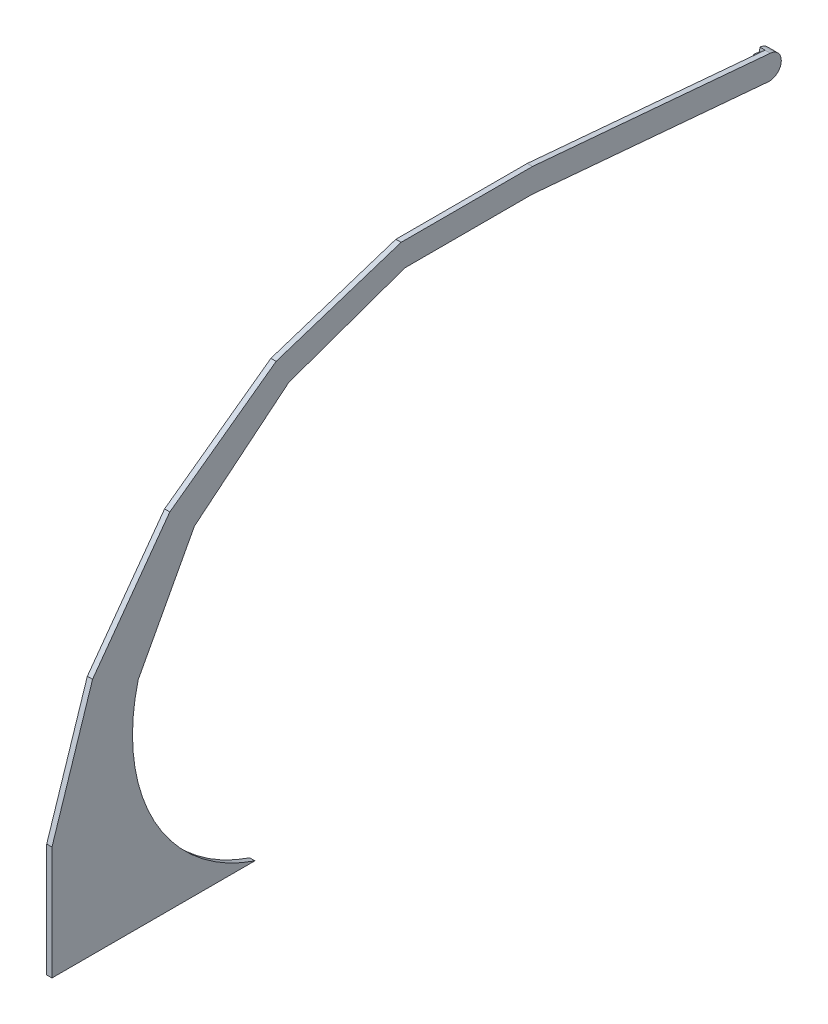
ISO-10303-21;
HEADER;
FILE_DESCRIPTION(('STEP AP214'),'2;1');
FILE_NAME('part.step','',(''),(''),'','','');
FILE_SCHEMA(('AUTOMOTIVE_DESIGN { 1 0 10303 214 1 1 1 1 }'));
ENDSEC;
DATA;
#1=APPLICATION_CONTEXT('core data for automotive mechanical design processes');
#2=APPLICATION_PROTOCOL_DEFINITION('international standard','automotive_design',2000,#1);
#3=PRODUCT_CONTEXT('',#1,'mechanical');
#4=PRODUCT('Part','Part','',(#3));
#5=PRODUCT_RELATED_PRODUCT_CATEGORY('part','',(#4));
#6=PRODUCT_DEFINITION_FORMATION('','',#4);
#7=PRODUCT_DEFINITION_CONTEXT('part definition',#1,'design');
#8=PRODUCT_DEFINITION('design','',#6,#7);
#9=PRODUCT_DEFINITION_SHAPE('','',#8);
#10=(LENGTH_UNIT() NAMED_UNIT(*) SI_UNIT(.MILLI.,.METRE.));
#11=(NAMED_UNIT(*) PLANE_ANGLE_UNIT() SI_UNIT($,.RADIAN.));
#12=(NAMED_UNIT(*) SI_UNIT($,.STERADIAN.) SOLID_ANGLE_UNIT());
#13=UNCERTAINTY_MEASURE_WITH_UNIT(LENGTH_MEASURE(1.E-05),#10,'distance_accuracy_value','');
#14=(GEOMETRIC_REPRESENTATION_CONTEXT(3) GLOBAL_UNCERTAINTY_ASSIGNED_CONTEXT((#13)) GLOBAL_UNIT_ASSIGNED_CONTEXT((#10,
#11,#12)) REPRESENTATION_CONTEXT('',''));
#15=CARTESIAN_POINT('',(0.,0.,0.));
#16=DIRECTION('',(0.,0.,1.));
#17=DIRECTION('',(1.,0.,0.));
#18=AXIS2_PLACEMENT_3D('',#15,#16,#17);
#19=CARTESIAN_POINT('',(-4.4,267.404770623516,-613.486850690672));
#20=DIRECTION('',(1.,0.,0.));
#21=DIRECTION('',(0.,0.,-1.));
#22=AXIS2_PLACEMENT_3D('',#19,#20,#21);
#23=PLANE('',#22);
#24=DIRECTION('',(0.,0.996194698091742,-0.0871557427476948));
#25=VECTOR('',#24,1.);
#26=CARTESIAN_POINT('',(-4.4,277.366717604433,-614.358408118148));
#27=LINE('',#26,#25);
#28=CARTESIAN_POINT('',(-4.4,274.17889457054,-614.079509741355));
#29=VERTEX_POINT('',#28);
#30=CARTESIAN_POINT('',(-4.4,277.366717604433,-614.358408118148));
#31=VERTEX_POINT('',#30);
#32=EDGE_CURVE('E50',#29,#31,#27,.T.);
#33=ORIENTED_EDGE('',*,*,#32,.F.);
#34=DIRECTION('',(0.,-0.0871557427476457,-0.996194698091747));
#35=VECTOR('',#34,1.);
#36=CARTESIAN_POINT('',(-4.4,274.17889457054,-614.079509741355));
#37=LINE('',#36,#35);
#38=CARTESIAN_POINT('',(-4.4,274.614673284278,-609.098536250897));
#39=VERTEX_POINT('',#38);
#40=EDGE_CURVE('E54',#39,#29,#37,.T.);
#41=ORIENTED_EDGE('',*,*,#40,.F.);
#42=DIRECTION('',(0.,0.996194698091747,-0.0871557427476402));
#43=VECTOR('',#42,1.);
#44=CARTESIAN_POINT('',(-4.4,274.614673284278,-609.098536250897));
#45=LINE('',#44,#43);
#46=CARTESIAN_POINT('',(-4.4,261.06642539023,-607.913218149529));
#47=VERTEX_POINT('',#46);
#48=EDGE_CURVE('E386',#47,#39,#45,.T.);
#49=ORIENTED_EDGE('',*,*,#48,.F.);
#50=DIRECTION('',(0.,0.0871557427476457,0.996194698091747));
#51=VECTOR('',#50,1.);
#52=CARTESIAN_POINT('',(-4.4,261.06642539023,-607.913218149529));
#53=LINE('',#52,#51);
#54=CARTESIAN_POINT('',(-4.4,260.630646676492,-612.894191639988));
#55=VERTEX_POINT('',#54);
#56=EDGE_CURVE('E391',#55,#47,#53,.T.);
#57=ORIENTED_EDGE('',*,*,#56,.F.);
#58=DIRECTION('',(0.,0.996194698091748,-0.087155742747626));
#59=VECTOR('',#58,1.);
#60=CARTESIAN_POINT('',(-4.4,260.630646676492,-612.894191639988));
#61=LINE('',#60,#59);
#62=CARTESIAN_POINT('',(-4.4,257.442823642599,-612.615293263195));
#63=VERTEX_POINT('',#62);
#64=EDGE_CURVE('E392',#63,#55,#61,.T.);
#65=ORIENTED_EDGE('',*,*,#64,.F.);
#66=DIRECTION('',(0.,-0.0871557427476516,-0.996194698091746));
#67=VECTOR('',#66,1.);
#68=CARTESIAN_POINT('',(-4.4,274.721469403097,-415.119468499799));
#69=LINE('',#68,#67);
#70=CARTESIAN_POINT('',(-4.4,274.721469403097,-415.119468499799));
#71=VERTEX_POINT('',#70);
#72=EDGE_CURVE('E227',#71,#63,#69,.T.);
#73=ORIENTED_EDGE('',*,*,#72,.F.);
#74=DIRECTION('',(0.,0.000294696357733536,-0.999999956577027));
#75=VECTOR('',#74,1.);
#76=CARTESIAN_POINT('',(-4.4,274.689971371937,-308.236471933466));
#77=LINE('',#76,#75);
#78=CARTESIAN_POINT('',(-4.4,274.689971371937,-308.236471933466));
#79=VERTEX_POINT('',#78);
#80=EDGE_CURVE('E224',#79,#71,#77,.T.);
#81=ORIENTED_EDGE('',*,*,#80,.F.);
#82=DIRECTION('',(0.,0.334370004593215,-0.942441881512241));
#83=VECTOR('',#82,1.);
#84=CARTESIAN_POINT('',(-4.4,240.150484060931,-210.884858568941));
#85=LINE('',#84,#83);
#86=CARTESIAN_POINT('',(-4.4,240.150484060931,-210.884858568941));
#87=VERTEX_POINT('',#86);
#88=EDGE_CURVE('E221',#87,#79,#85,.T.);
#89=ORIENTED_EDGE('',*,*,#88,.F.);
#90=DIRECTION('',(0.,0.633633933360536,-0.773633012800033));
#91=VECTOR('',#90,1.);
#92=CARTESIAN_POINT('',(-4.4,175.483372312741,-131.929787104417));
#93=LINE('',#92,#91);
#94=CARTESIAN_POINT('',(-4.4,175.483372312741,-131.929787104417));
#95=VERTEX_POINT('',#94);
#96=EDGE_CURVE('E218',#95,#87,#93,.T.);
#97=ORIENTED_EDGE('',*,*,#96,.F.);
#98=DIRECTION('',(0.,0.881428156878639,-0.47231811765115));
#99=VECTOR('',#98,1.);
#100=CARTESIAN_POINT('',(-4.4,87.5793685008101,-84.8259439943004));
#101=LINE('',#100,#99);
#102=CARTESIAN_POINT('',(-4.4,87.5793685008101,-84.8259439943003));
#103=VERTEX_POINT('',#102);
#104=EDGE_CURVE('E215',#103,#95,#101,.T.);
#105=ORIENTED_EDGE('',*,*,#104,.F.);
#106=CARTESIAN_POINT('',(-4.4,49.9964815633779,-230.514269051647));
#107=DIRECTION('',(-1.,0.,0.));
#108=DIRECTION('',(0.,0.,-1.));
#109=AXIS2_PLACEMENT_3D('',#106,#107,#108);
#110=CIRCLE('',#109,150.457839438717);
#111=CARTESIAN_POINT('',(-4.4,-92.6332823955664,-182.615293263195));
#112=VERTEX_POINT('',#111);
#113=EDGE_CURVE('E212',#112,#103,#110,.T.);
#114=ORIENTED_EDGE('',*,*,#113,.F.);
#115=DIRECTION('',(0.,0.,-1.));
#116=VECTOR('',#115,1.);
#117=CARTESIAN_POINT('',(-4.4,-92.6332823955664,-12.615293263195));
#118=LINE('',#117,#116);
#119=CARTESIAN_POINT('',(-4.4,-92.6332823955664,-12.615293263195));
#120=VERTEX_POINT('',#119);
#121=EDGE_CURVE('E208',#120,#112,#118,.T.);
#122=ORIENTED_EDGE('',*,*,#121,.F.);
#123=DIRECTION('',(0.,-1.,0.));
#124=VECTOR('',#123,1.);
#125=CARTESIAN_POINT('',(-4.4,-92.6332823955664,-12.615293263195));
#126=LINE('',#125,#124);
#127=CARTESIAN_POINT('',(-4.4,2.36146514484749,-12.6152932631949));
#128=VERTEX_POINT('',#127);
#129=EDGE_CURVE('E205',#128,#120,#126,.T.);
#130=ORIENTED_EDGE('',*,*,#129,.F.);
#131=DIRECTION('',(0.,-0.951056516295155,0.309016994374944));
#132=VECTOR('',#131,1.);
#133=CARTESIAN_POINT('',(-4.4,2.36146514484749,-12.6152932631949));
#134=LINE('',#133,#132);
#135=CARTESIAN_POINT('',(-4.4,107.042139058005,-46.6281060325135));
#136=VERTEX_POINT('',#135);
#137=EDGE_CURVE('E244',#136,#128,#134,.T.);
#138=ORIENTED_EDGE('',*,*,#137,.F.);
#139=DIRECTION('',(0.,-0.809016994374949,0.587785252292471));
#140=VECTOR('',#139,1.);
#141=CARTESIAN_POINT('',(-4.4,107.042139058005,-46.6281060325135));
#142=LINE('',#141,#140);
#143=CARTESIAN_POINT('',(-4.4,196.088838941069,-111.324320476089));
#144=VERTEX_POINT('',#143);
#145=EDGE_CURVE('E241',#144,#136,#142,.T.);
#146=ORIENTED_EDGE('',*,*,#145,.F.);
#147=DIRECTION('',(0.,-0.587785252292475,0.809016994374946));
#148=VECTOR('',#147,1.);
#149=CARTESIAN_POINT('',(-4.4,196.088838941069,-111.324320476089));
#150=LINE('',#149,#148);
#151=CARTESIAN_POINT('',(-4.4,260.785053384645,-200.371020359152));
#152=VERTEX_POINT('',#151);
#153=EDGE_CURVE('E238',#152,#144,#150,.T.);
#154=ORIENTED_EDGE('',*,*,#153,.F.);
#155=DIRECTION('',(0.,-0.309016994374949,0.951056516295153));
#156=VECTOR('',#155,1.);
#157=CARTESIAN_POINT('',(-4.4,260.785053384645,-200.371020359152));
#158=LINE('',#157,#156);
#159=CARTESIAN_POINT('',(-4.4,294.797866153964,-305.05169427231));
#160=VERTEX_POINT('',#159);
#161=EDGE_CURVE('E235',#160,#152,#158,.T.);
#162=ORIENTED_EDGE('',*,*,#161,.F.);
#163=DIRECTION('',(0.,0.,1.));
#164=VECTOR('',#163,1.);
#165=CARTESIAN_POINT('',(-4.4,294.797866153964,-305.05169427231));
#166=LINE('',#165,#164);
#167=CARTESIAN_POINT('',(-4.4,294.797866153964,-415.119468499799));
#168=VERTEX_POINT('',#167);
#169=EDGE_CURVE('E232',#168,#160,#166,.T.);
#170=ORIENTED_EDGE('',*,*,#169,.F.);
#171=DIRECTION('',(0.,0.0871557427476516,0.996194698091746));
#172=VECTOR('',#171,1.);
#173=CARTESIAN_POINT('',(-4.4,277.366717604433,-614.358408118148));
#174=LINE('',#173,#172);
#175=EDGE_CURVE('E229',#31,#168,#174,.T.);
#176=ORIENTED_EDGE('',*,*,#175,.F.);
#177=EDGE_LOOP('',(#33,#41,#49,#57,#65,#73,#81,#89,#97,#105,#114,#122,#130,#138,#146,#154,#162,
#170,#176));
#178=FACE_BOUND('',#177,.T.);
#179=ADVANCED_FACE('F33',(#178),#23,.F.);
#180=CARTESIAN_POINT('',(-4.4,-92.6332823955664,-12.615293263195));
#181=DIRECTION('',(0.,0.,1.));
#182=DIRECTION('',(0.,-1.,0.));
#183=AXIS2_PLACEMENT_3D('',#180,#181,#182);
#184=PLANE('',#183);
#185=DIRECTION('',(0.,-1.,0.));
#186=VECTOR('',#185,1.);
#187=CARTESIAN_POINT('',(0.,-92.6332823955664,-12.615293263195));
#188=LINE('',#187,#186);
#189=CARTESIAN_POINT('',(0.,2.36146514484749,-12.6152932631949));
#190=VERTEX_POINT('',#189);
#191=CARTESIAN_POINT('',(0.,-92.6332823955664,-12.615293263195));
#192=VERTEX_POINT('',#191);
#193=EDGE_CURVE('E196',#190,#192,#188,.T.);
#194=ORIENTED_EDGE('',*,*,#193,.F.);
#195=DIRECTION('',(1.,0.,0.));
#196=VECTOR('',#195,1.);
#197=CARTESIAN_POINT('',(-4.4,2.36146514484749,-12.6152932631949));
#198=LINE('',#197,#196);
#199=EDGE_CURVE('E11',#128,#190,#198,.T.);
#200=ORIENTED_EDGE('',*,*,#199,.F.);
#201=ORIENTED_EDGE('',*,*,#129,.T.);
#202=DIRECTION('',(1.,0.,0.));
#203=VECTOR('',#202,1.);
#204=CARTESIAN_POINT('',(-4.4,-92.6332823955664,-12.615293263195));
#205=LINE('',#204,#203);
#206=EDGE_CURVE('E37',#120,#192,#205,.T.);
#207=ORIENTED_EDGE('',*,*,#206,.T.);
#208=EDGE_LOOP('',(#194,#200,#201,#207));
#209=FACE_BOUND('',#208,.T.);
#210=ADVANCED_FACE('F35',(#209),#184,.T.);
#211=CARTESIAN_POINT('',(-4.4,2.36146514484749,-12.6152932631949));
#212=DIRECTION('',(0.,0.309016994374944,0.951056516295155));
#213=DIRECTION('',(0.,-0.951056516295155,0.309016994374944));
#214=AXIS2_PLACEMENT_3D('',#211,#212,#213);
#215=PLANE('',#214);
#216=DIRECTION('',(0.,-0.951056516295155,0.309016994374944));
#217=VECTOR('',#216,1.);
#218=CARTESIAN_POINT('',(0.,2.36146514484749,-12.6152932631949));
#219=LINE('',#218,#217);
#220=CARTESIAN_POINT('',(0.,107.042139058005,-46.6281060325135));
#221=VERTEX_POINT('',#220);
#222=EDGE_CURVE('E209',#221,#190,#219,.T.);
#223=ORIENTED_EDGE('',*,*,#222,.F.);
#224=DIRECTION('',(1.,0.,0.));
#225=VECTOR('',#224,1.);
#226=CARTESIAN_POINT('',(-4.4,107.042139058005,-46.6281060325135));
#227=LINE('',#226,#225);
#228=EDGE_CURVE('E42',#136,#221,#227,.T.);
#229=ORIENTED_EDGE('',*,*,#228,.F.);
#230=ORIENTED_EDGE('',*,*,#137,.T.);
#231=ORIENTED_EDGE('',*,*,#199,.T.);
#232=EDGE_LOOP('',(#223,#229,#230,#231));
#233=FACE_BOUND('',#232,.T.);
#234=ADVANCED_FACE('F322',(#233),#215,.T.);
#235=CARTESIAN_POINT('',(-4.4,107.042139058005,-46.6281060325135));
#236=DIRECTION('',(0.,0.587785252292471,0.809016994374949));
#237=DIRECTION('',(0.,-0.809016994374949,0.587785252292471));
#238=AXIS2_PLACEMENT_3D('',#235,#236,#237);
#239=PLANE('',#238);
#240=DIRECTION('',(0.,-0.809016994374949,0.587785252292471));
#241=VECTOR('',#240,1.);
#242=CARTESIAN_POINT('',(0.,107.042139058005,-46.6281060325135));
#243=LINE('',#242,#241);
#244=CARTESIAN_POINT('',(0.,196.088838941069,-111.324320476089));
#245=VERTEX_POINT('',#244);
#246=EDGE_CURVE('E282',#245,#221,#243,.T.);
#247=ORIENTED_EDGE('',*,*,#246,.F.);
#248=DIRECTION('',(1.,0.,0.));
#249=VECTOR('',#248,1.);
#250=CARTESIAN_POINT('',(-4.4,196.088838941069,-111.324320476089));
#251=LINE('',#250,#249);
#252=EDGE_CURVE('E288',#144,#245,#251,.T.);
#253=ORIENTED_EDGE('',*,*,#252,.F.);
#254=ORIENTED_EDGE('',*,*,#145,.T.);
#255=ORIENTED_EDGE('',*,*,#228,.T.);
#256=EDGE_LOOP('',(#247,#253,#254,#255));
#257=FACE_BOUND('',#256,.T.);
#258=ADVANCED_FACE('F364',(#257),#239,.T.);
#259=CARTESIAN_POINT('',(-4.4,196.088838941069,-111.324320476089));
#260=DIRECTION('',(0.,0.809016994374946,0.587785252292475));
#261=DIRECTION('',(0.,-0.587785252292475,0.809016994374946));
#262=AXIS2_PLACEMENT_3D('',#259,#260,#261);
#263=PLANE('',#262);
#264=DIRECTION('',(0.,-0.587785252292475,0.809016994374946));
#265=VECTOR('',#264,1.);
#266=CARTESIAN_POINT('',(0.,196.088838941069,-111.324320476089));
#267=LINE('',#266,#265);
#268=CARTESIAN_POINT('',(0.,260.785053384645,-200.371020359152));
#269=VERTEX_POINT('',#268);
#270=EDGE_CURVE('E279',#269,#245,#267,.T.);
#271=ORIENTED_EDGE('',*,*,#270,.F.);
#272=DIRECTION('',(1.,0.,0.));
#273=VECTOR('',#272,1.);
#274=CARTESIAN_POINT('',(-4.4,260.785053384645,-200.371020359152));
#275=LINE('',#274,#273);
#276=EDGE_CURVE('E290',#152,#269,#275,.T.);
#277=ORIENTED_EDGE('',*,*,#276,.F.);
#278=ORIENTED_EDGE('',*,*,#153,.T.);
#279=ORIENTED_EDGE('',*,*,#252,.T.);
#280=EDGE_LOOP('',(#271,#277,#278,#279));
#281=FACE_BOUND('',#280,.T.);
#282=ADVANCED_FACE('F361',(#281),#263,.T.);
#283=CARTESIAN_POINT('',(-4.4,260.785053384645,-200.371020359152));
#284=DIRECTION('',(0.,0.951056516295153,0.309016994374949));
#285=DIRECTION('',(0.,-0.309016994374949,0.951056516295153));
#286=AXIS2_PLACEMENT_3D('',#283,#284,#285);
#287=PLANE('',#286);
#288=DIRECTION('',(0.,-0.309016994374949,0.951056516295153));
#289=VECTOR('',#288,1.);
#290=CARTESIAN_POINT('',(0.,260.785053384645,-200.371020359152));
#291=LINE('',#290,#289);
#292=CARTESIAN_POINT('',(0.,294.797866153964,-305.05169427231));
#293=VERTEX_POINT('',#292);
#294=EDGE_CURVE('E276',#293,#269,#291,.T.);
#295=ORIENTED_EDGE('',*,*,#294,.F.);
#296=DIRECTION('',(1.,0.,0.));
#297=VECTOR('',#296,1.);
#298=CARTESIAN_POINT('',(-4.4,294.797866153964,-305.05169427231));
#299=LINE('',#298,#297);
#300=EDGE_CURVE('E292',#160,#293,#299,.T.);
#301=ORIENTED_EDGE('',*,*,#300,.F.);
#302=ORIENTED_EDGE('',*,*,#161,.T.);
#303=ORIENTED_EDGE('',*,*,#276,.T.);
#304=EDGE_LOOP('',(#295,#301,#302,#303));
#305=FACE_BOUND('',#304,.T.);
#306=ADVANCED_FACE('F358',(#305),#287,.T.);
#307=CARTESIAN_POINT('',(-4.4,294.797866153964,-305.05169427231));
#308=DIRECTION('',(0.,1.,0.));
#309=DIRECTION('',(0.,0.,1.));
#310=AXIS2_PLACEMENT_3D('',#307,#308,#309);
#311=PLANE('',#310);
#312=DIRECTION('',(0.,0.,1.));
#313=VECTOR('',#312,1.);
#314=CARTESIAN_POINT('',(0.,294.797866153964,-305.05169427231));
#315=LINE('',#314,#313);
#316=CARTESIAN_POINT('',(0.,294.797866153964,-415.119468499799));
#317=VERTEX_POINT('',#316);
#318=EDGE_CURVE('E273',#317,#293,#315,.T.);
#319=ORIENTED_EDGE('',*,*,#318,.F.);
#320=DIRECTION('',(1.,0.,0.));
#321=VECTOR('',#320,1.);
#322=CARTESIAN_POINT('',(-4.4,294.797866153964,-415.119468499799));
#323=LINE('',#322,#321);
#324=EDGE_CURVE('E294',#168,#317,#323,.T.);
#325=ORIENTED_EDGE('',*,*,#324,.F.);
#326=ORIENTED_EDGE('',*,*,#169,.T.);
#327=ORIENTED_EDGE('',*,*,#300,.T.);
#328=EDGE_LOOP('',(#319,#325,#326,#327));
#329=FACE_BOUND('',#328,.T.);
#330=ADVANCED_FACE('F354',(#329),#311,.T.);
#331=CARTESIAN_POINT('',(-4.4,277.366717604433,-614.358408118148));
#332=DIRECTION('',(0.,0.996194698091746,-0.0871557427476516));
#333=DIRECTION('',(0.,0.0871557427476516,0.996194698091746));
#334=AXIS2_PLACEMENT_3D('',#331,#332,#333);
#335=PLANE('',#334);
#336=DIRECTION('',(0.,0.0871557427476516,0.996194698091746));
#337=VECTOR('',#336,1.);
#338=CARTESIAN_POINT('',(0.,277.366717604433,-614.358408118148));
#339=LINE('',#338,#337);
#340=CARTESIAN_POINT('',(0.,277.366717604433,-614.358408118148));
#341=VERTEX_POINT('',#340);
#342=EDGE_CURVE('E270',#341,#317,#339,.T.);
#343=ORIENTED_EDGE('',*,*,#342,.F.);
#344=DIRECTION('',(1.,0.,0.));
#345=VECTOR('',#344,1.);
#346=CARTESIAN_POINT('',(-4.4,277.366717604433,-614.358408118148));
#347=LINE('',#346,#345);
#348=EDGE_CURVE('E296',#31,#341,#347,.T.);
#349=ORIENTED_EDGE('',*,*,#348,.F.);
#350=ORIENTED_EDGE('',*,*,#175,.T.);
#351=ORIENTED_EDGE('',*,*,#324,.T.);
#352=EDGE_LOOP('',(#343,#349,#350,#351));
#353=FACE_BOUND('',#352,.T.);
#354=ADVANCED_FACE('F351',(#353),#335,.T.);
#355=CARTESIAN_POINT('',(-4.4,267.404770623516,-613.486850690672));
#356=DIRECTION('',(1.,0.,0.));
#357=DIRECTION('',(0.,0.,-1.));
#358=AXIS2_PLACEMENT_3D('',#355,#356,#357);
#359=CYLINDRICAL_SURFACE('',#358,9.99999999999999);
#360=CARTESIAN_POINT('',(0.,267.404770623516,-613.486850690672));
#361=DIRECTION('',(1.,0.,0.));
#362=DIRECTION('',(0.,0.,-1.));
#363=AXIS2_PLACEMENT_3D('',#360,#361,#362);
#364=CIRCLE('',#363,9.99999999999999);
#365=CARTESIAN_POINT('',(0.,257.442823642599,-612.615293263195));
#366=VERTEX_POINT('',#365);
#367=EDGE_CURVE('E267',#366,#341,#364,.T.);
#368=ORIENTED_EDGE('',*,*,#367,.F.);
#369=DIRECTION('',(1.,0.,0.));
#370=VECTOR('',#369,1.);
#371=CARTESIAN_POINT('',(-4.4,257.442823642599,-612.615293263195));
#372=LINE('',#371,#370);
#373=EDGE_CURVE('E194',#63,#366,#372,.T.);
#374=ORIENTED_EDGE('',*,*,#373,.F.);
#375=DIRECTION('',(1.,0.,0.));
#376=VECTOR('',#375,1.);
#377=CARTESIAN_POINT('',(-8.8,257.442823642599,-612.615293263195));
#378=LINE('',#377,#376);
#379=CARTESIAN_POINT('',(-8.8,257.442823642599,-612.615293263195));
#380=VERTEX_POINT('',#379);
#381=EDGE_CURVE('E175',#380,#63,#378,.T.);
#382=ORIENTED_EDGE('',*,*,#381,.F.);
#383=CARTESIAN_POINT('',(-8.8,267.404770623516,-613.486850690672));
#384=DIRECTION('',(-1.,0.,0.));
#385=DIRECTION('',(0.,0.,1.));
#386=AXIS2_PLACEMENT_3D('',#383,#384,#385);
#387=CIRCLE('',#386,9.99999999999999);
#388=CARTESIAN_POINT('',(-8.8,277.366717604433,-614.358408118148));
#389=VERTEX_POINT('',#388);
#390=EDGE_CURVE('E181',#389,#380,#387,.T.);
#391=ORIENTED_EDGE('',*,*,#390,.F.);
#392=DIRECTION('',(1.,0.,0.));
#393=VECTOR('',#392,1.);
#394=CARTESIAN_POINT('',(-8.8,277.366717604433,-614.358408118148));
#395=LINE('',#394,#393);
#396=EDGE_CURVE('E368',#389,#31,#395,.T.);
#397=ORIENTED_EDGE('',*,*,#396,.T.);
#398=ORIENTED_EDGE('',*,*,#348,.T.);
#399=EDGE_LOOP('',(#368,#374,#382,#391,#397,#398));
#400=FACE_BOUND('',#399,.T.);
#401=ADVANCED_FACE('F193',(#400),#359,.T.);
#402=CARTESIAN_POINT('',(-4.4,274.721469403097,-415.119468499799));
#403=DIRECTION('',(0.,-0.996194698091746,0.0871557427476516));
#404=DIRECTION('',(0.,-0.0871557427476516,-0.996194698091746));
#405=AXIS2_PLACEMENT_3D('',#402,#403,#404);
#406=PLANE('',#405);
#407=DIRECTION('',(0.,-0.0871557427476516,-0.996194698091746));
#408=VECTOR('',#407,1.);
#409=CARTESIAN_POINT('',(0.,274.721469403097,-415.119468499799));
#410=LINE('',#409,#408);
#411=CARTESIAN_POINT('',(0.,274.721469403097,-415.119468499799));
#412=VERTEX_POINT('',#411);
#413=EDGE_CURVE('E264',#412,#366,#410,.T.);
#414=ORIENTED_EDGE('',*,*,#413,.F.);
#415=DIRECTION('',(1.,0.,0.));
#416=VECTOR('',#415,1.);
#417=CARTESIAN_POINT('',(-4.4,274.721469403097,-415.119468499799));
#418=LINE('',#417,#416);
#419=EDGE_CURVE('E299',#71,#412,#418,.T.);
#420=ORIENTED_EDGE('',*,*,#419,.F.);
#421=ORIENTED_EDGE('',*,*,#72,.T.);
#422=ORIENTED_EDGE('',*,*,#373,.T.);
#423=EDGE_LOOP('',(#414,#420,#421,#422));
#424=FACE_BOUND('',#423,.T.);
#425=ADVANCED_FACE('F347',(#424),#406,.T.);
#426=CARTESIAN_POINT('',(-4.4,274.689971371937,-308.236471933466));
#427=DIRECTION('',(0.,-0.999999956577027,-0.000294696357733536));
#428=DIRECTION('',(0.,0.000294696357733536,-0.999999956577027));
#429=AXIS2_PLACEMENT_3D('',#426,#427,#428);
#430=PLANE('',#429);
#431=DIRECTION('',(0.,0.000294696357733536,-0.999999956577027));
#432=VECTOR('',#431,1.);
#433=CARTESIAN_POINT('',(0.,274.689971371937,-308.236471933466));
#434=LINE('',#433,#432);
#435=CARTESIAN_POINT('',(0.,274.689971371937,-308.236471933466));
#436=VERTEX_POINT('',#435);
#437=EDGE_CURVE('E261',#436,#412,#434,.T.);
#438=ORIENTED_EDGE('',*,*,#437,.F.);
#439=DIRECTION('',(1.,0.,0.));
#440=VECTOR('',#439,1.);
#441=CARTESIAN_POINT('',(-4.4,274.689971371937,-308.236471933466));
#442=LINE('',#441,#440);
#443=EDGE_CURVE('E301',#79,#436,#442,.T.);
#444=ORIENTED_EDGE('',*,*,#443,.F.);
#445=ORIENTED_EDGE('',*,*,#80,.T.);
#446=ORIENTED_EDGE('',*,*,#419,.T.);
#447=EDGE_LOOP('',(#438,#444,#445,#446));
#448=FACE_BOUND('',#447,.T.);
#449=ADVANCED_FACE('F343',(#448),#430,.T.);
#450=CARTESIAN_POINT('',(-4.4,240.150484060931,-210.884858568941));
#451=DIRECTION('',(0.,-0.942441881512241,-0.334370004593215));
#452=DIRECTION('',(0.,0.334370004593215,-0.942441881512241));
#453=AXIS2_PLACEMENT_3D('',#450,#451,#452);
#454=PLANE('',#453);
#455=DIRECTION('',(0.,0.334370004593215,-0.942441881512241));
#456=VECTOR('',#455,1.);
#457=CARTESIAN_POINT('',(0.,240.150484060931,-210.884858568941));
#458=LINE('',#457,#456);
#459=CARTESIAN_POINT('',(0.,240.150484060931,-210.884858568941));
#460=VERTEX_POINT('',#459);
#461=EDGE_CURVE('E258',#460,#436,#458,.T.);
#462=ORIENTED_EDGE('',*,*,#461,.F.);
#463=DIRECTION('',(1.,0.,0.));
#464=VECTOR('',#463,1.);
#465=CARTESIAN_POINT('',(-4.4,240.150484060931,-210.884858568941));
#466=LINE('',#465,#464);
#467=EDGE_CURVE('E303',#87,#460,#466,.T.);
#468=ORIENTED_EDGE('',*,*,#467,.F.);
#469=ORIENTED_EDGE('',*,*,#88,.T.);
#470=ORIENTED_EDGE('',*,*,#443,.T.);
#471=EDGE_LOOP('',(#462,#468,#469,#470));
#472=FACE_BOUND('',#471,.T.);
#473=ADVANCED_FACE('F339',(#472),#454,.T.);
#474=CARTESIAN_POINT('',(-4.4,175.483372312741,-131.929787104417));
#475=DIRECTION('',(0.,-0.773633012800033,-0.633633933360536));
#476=DIRECTION('',(0.,0.633633933360536,-0.773633012800033));
#477=AXIS2_PLACEMENT_3D('',#474,#475,#476);
#478=PLANE('',#477);
#479=DIRECTION('',(0.,0.633633933360536,-0.773633012800033));
#480=VECTOR('',#479,1.);
#481=CARTESIAN_POINT('',(0.,175.483372312741,-131.929787104417));
#482=LINE('',#481,#480);
#483=CARTESIAN_POINT('',(0.,175.483372312741,-131.929787104417));
#484=VERTEX_POINT('',#483);
#485=EDGE_CURVE('E255',#484,#460,#482,.T.);
#486=ORIENTED_EDGE('',*,*,#485,.F.);
#487=DIRECTION('',(1.,0.,0.));
#488=VECTOR('',#487,1.);
#489=CARTESIAN_POINT('',(-4.4,175.483372312741,-131.929787104417));
#490=LINE('',#489,#488);
#491=EDGE_CURVE('E305',#95,#484,#490,.T.);
#492=ORIENTED_EDGE('',*,*,#491,.F.);
#493=ORIENTED_EDGE('',*,*,#96,.T.);
#494=ORIENTED_EDGE('',*,*,#467,.T.);
#495=EDGE_LOOP('',(#486,#492,#493,#494));
#496=FACE_BOUND('',#495,.T.);
#497=ADVANCED_FACE('F335',(#496),#478,.T.);
#498=CARTESIAN_POINT('',(-4.4,87.5793685008101,-84.8259439943004));
#499=DIRECTION('',(0.,-0.47231811765115,-0.881428156878639));
#500=DIRECTION('',(0.,0.881428156878639,-0.47231811765115));
#501=AXIS2_PLACEMENT_3D('',#498,#499,#500);
#502=PLANE('',#501);
#503=DIRECTION('',(0.,0.881428156878639,-0.47231811765115));
#504=VECTOR('',#503,1.);
#505=CARTESIAN_POINT('',(0.,87.5793685008101,-84.8259439943004));
#506=LINE('',#505,#504);
#507=CARTESIAN_POINT('',(0.,87.5793685008101,-84.8259439943003));
#508=VERTEX_POINT('',#507);
#509=EDGE_CURVE('E252',#508,#484,#506,.T.);
#510=ORIENTED_EDGE('',*,*,#509,.F.);
#511=DIRECTION('',(1.,0.,0.));
#512=VECTOR('',#511,1.);
#513=CARTESIAN_POINT('',(-4.4,87.5793685008101,-84.8259439943003));
#514=LINE('',#513,#512);
#515=EDGE_CURVE('E307',#103,#508,#514,.T.);
#516=ORIENTED_EDGE('',*,*,#515,.F.);
#517=ORIENTED_EDGE('',*,*,#104,.T.);
#518=ORIENTED_EDGE('',*,*,#491,.T.);
#519=EDGE_LOOP('',(#510,#516,#517,#518));
#520=FACE_BOUND('',#519,.T.);
#521=ADVANCED_FACE('F333',(#520),#502,.T.);
#522=CARTESIAN_POINT('',(-4.4,49.9964815633779,-230.514269051647));
#523=DIRECTION('',(1.,0.,0.));
#524=DIRECTION('',(0.,0.,-1.));
#525=AXIS2_PLACEMENT_3D('',#522,#523,#524);
#526=CYLINDRICAL_SURFACE('',#525,150.457839438717);
#527=CARTESIAN_POINT('',(0.,49.9964815633779,-230.514269051647));
#528=DIRECTION('',(-1.,0.,0.));
#529=DIRECTION('',(0.,0.,-1.));
#530=AXIS2_PLACEMENT_3D('',#527,#528,#529);
#531=CIRCLE('',#530,150.457839438717);
#532=CARTESIAN_POINT('',(0.,-92.6332823955664,-182.615293263195));
#533=VERTEX_POINT('',#532);
#534=EDGE_CURVE('E249',#533,#508,#531,.T.);
#535=ORIENTED_EDGE('',*,*,#534,.F.);
#536=DIRECTION('',(1.,0.,0.));
#537=VECTOR('',#536,1.);
#538=CARTESIAN_POINT('',(-4.4,-92.6332823955664,-182.615293263195));
#539=LINE('',#538,#537);
#540=EDGE_CURVE('E308',#112,#533,#539,.T.);
#541=ORIENTED_EDGE('',*,*,#540,.F.);
#542=ORIENTED_EDGE('',*,*,#113,.T.);
#543=ORIENTED_EDGE('',*,*,#515,.T.);
#544=EDGE_LOOP('',(#535,#541,#542,#543));
#545=FACE_BOUND('',#544,.T.);
#546=ADVANCED_FACE('F329',(#545),#526,.F.);
#547=CARTESIAN_POINT('',(-4.4,-92.6332823955664,-12.615293263195));
#548=DIRECTION('',(0.,-1.,0.));
#549=DIRECTION('',(0.,0.,-1.));
#550=AXIS2_PLACEMENT_3D('',#547,#548,#549);
#551=PLANE('',#550);
#552=DIRECTION('',(0.,0.,-1.));
#553=VECTOR('',#552,1.);
#554=CARTESIAN_POINT('',(0.,-92.6332823955664,-12.615293263195));
#555=LINE('',#554,#553);
#556=EDGE_CURVE('E199',#192,#533,#555,.T.);
#557=ORIENTED_EDGE('',*,*,#556,.F.);
#558=ORIENTED_EDGE('',*,*,#206,.F.);
#559=ORIENTED_EDGE('',*,*,#121,.T.);
#560=ORIENTED_EDGE('',*,*,#540,.T.);
#561=EDGE_LOOP('',(#557,#558,#559,#560));
#562=FACE_BOUND('',#561,.T.);
#563=ADVANCED_FACE('F316',(#562),#551,.T.);
#564=CARTESIAN_POINT('',(0.,267.404770623516,-613.486850690672));
#565=DIRECTION('',(1.,0.,0.));
#566=DIRECTION('',(0.,0.,-1.));
#567=AXIS2_PLACEMENT_3D('',#564,#565,#566);
#568=PLANE('',#567);
#569=ORIENTED_EDGE('',*,*,#193,.T.);
#570=ORIENTED_EDGE('',*,*,#556,.T.);
#571=ORIENTED_EDGE('',*,*,#534,.T.);
#572=ORIENTED_EDGE('',*,*,#509,.T.);
#573=ORIENTED_EDGE('',*,*,#485,.T.);
#574=ORIENTED_EDGE('',*,*,#461,.T.);
#575=ORIENTED_EDGE('',*,*,#437,.T.);
#576=ORIENTED_EDGE('',*,*,#413,.T.);
#577=ORIENTED_EDGE('',*,*,#367,.T.);
#578=ORIENTED_EDGE('',*,*,#342,.T.);
#579=ORIENTED_EDGE('',*,*,#318,.T.);
#580=ORIENTED_EDGE('',*,*,#294,.T.);
#581=ORIENTED_EDGE('',*,*,#270,.T.);
#582=ORIENTED_EDGE('',*,*,#246,.T.);
#583=ORIENTED_EDGE('',*,*,#222,.T.);
#584=EDGE_LOOP('',(#569,#570,#571,#572,#573,#574,#575,#576,#577,#578,#579,#580,#581,#582,#583));
#585=FACE_BOUND('',#584,.T.);
#586=ADVANCED_FACE('F318',(#585),#568,.T.);
#587=CARTESIAN_POINT('',(-8.8,260.630646676492,-612.894191639988));
#588=DIRECTION('',(0.,-0.087155742747626,-0.996194698091748));
#589=DIRECTION('',(0.,0.996194698091748,-0.087155742747626));
#590=AXIS2_PLACEMENT_3D('',#587,#588,#589);
#591=PLANE('',#590);
#592=ORIENTED_EDGE('',*,*,#64,.T.);
#593=DIRECTION('',(1.,0.,0.));
#594=VECTOR('',#593,1.);
#595=CARTESIAN_POINT('',(-8.8,260.630646676492,-612.894191639988));
#596=LINE('',#595,#594);
#597=CARTESIAN_POINT('',(-8.8,260.630646676492,-612.894191639988));
#598=VERTEX_POINT('',#597);
#599=EDGE_CURVE('E177',#598,#55,#596,.T.);
#600=ORIENTED_EDGE('',*,*,#599,.F.);
#601=DIRECTION('',(0.,0.996194698091748,-0.087155742747626));
#602=VECTOR('',#601,1.);
#603=CARTESIAN_POINT('',(-8.8,260.630646676492,-612.894191639988));
#604=LINE('',#603,#602);
#605=EDGE_CURVE('E170',#380,#598,#604,.T.);
#606=ORIENTED_EDGE('',*,*,#605,.F.);
#607=ORIENTED_EDGE('',*,*,#381,.T.);
#608=EDGE_LOOP('',(#592,#600,#606,#607));
#609=FACE_BOUND('',#608,.T.);
#610=ADVANCED_FACE('F173',(#609),#591,.F.);
#611=CARTESIAN_POINT('',(-8.8,261.06642539023,-607.913218149529));
#612=DIRECTION('',(0.,0.996194698091747,-0.0871557427476457));
#613=DIRECTION('',(0.,0.0871557427476457,0.996194698091747));
#614=AXIS2_PLACEMENT_3D('',#611,#612,#613);
#615=PLANE('',#614);
#616=ORIENTED_EDGE('',*,*,#56,.T.);
#617=DIRECTION('',(1.,0.,0.));
#618=VECTOR('',#617,1.);
#619=CARTESIAN_POINT('',(-8.8,261.06642539023,-607.913218149529));
#620=LINE('',#619,#618);
#621=CARTESIAN_POINT('',(-8.8,261.06642539023,-607.913218149529));
#622=VERTEX_POINT('',#621);
#623=EDGE_CURVE('E201',#622,#47,#620,.T.);
#624=ORIENTED_EDGE('',*,*,#623,.F.);
#625=DIRECTION('',(0.,0.0871557427476457,0.996194698091747));
#626=VECTOR('',#625,1.);
#627=CARTESIAN_POINT('',(-8.8,261.06642539023,-607.913218149529));
#628=LINE('',#627,#626);
#629=EDGE_CURVE('E180',#598,#622,#628,.T.);
#630=ORIENTED_EDGE('',*,*,#629,.F.);
#631=ORIENTED_EDGE('',*,*,#599,.T.);
#632=EDGE_LOOP('',(#616,#624,#630,#631));
#633=FACE_BOUND('',#632,.T.);
#634=ADVANCED_FACE('F390',(#633),#615,.F.);
#635=CARTESIAN_POINT('',(-8.8,274.614673284278,-609.098536250897));
#636=DIRECTION('',(0.,-0.0871557427476402,-0.996194698091747));
#637=DIRECTION('',(0.,0.996194698091747,-0.0871557427476402));
#638=AXIS2_PLACEMENT_3D('',#635,#636,#637);
#639=PLANE('',#638);
#640=ORIENTED_EDGE('',*,*,#48,.T.);
#641=DIRECTION('',(1.,0.,0.));
#642=VECTOR('',#641,1.);
#643=CARTESIAN_POINT('',(-8.8,274.614673284278,-609.098536250897));
#644=LINE('',#643,#642);
#645=CARTESIAN_POINT('',(-8.8,274.614673284278,-609.098536250897));
#646=VERTEX_POINT('',#645);
#647=EDGE_CURVE('E373',#646,#39,#644,.T.);
#648=ORIENTED_EDGE('',*,*,#647,.F.);
#649=DIRECTION('',(0.,0.996194698091747,-0.0871557427476402));
#650=VECTOR('',#649,1.);
#651=CARTESIAN_POINT('',(-8.8,274.614673284278,-609.098536250897));
#652=LINE('',#651,#650);
#653=EDGE_CURVE('E387',#622,#646,#652,.T.);
#654=ORIENTED_EDGE('',*,*,#653,.F.);
#655=ORIENTED_EDGE('',*,*,#623,.T.);
#656=EDGE_LOOP('',(#640,#648,#654,#655));
#657=FACE_BOUND('',#656,.T.);
#658=ADVANCED_FACE('F384',(#657),#639,.F.);
#659=CARTESIAN_POINT('',(-8.8,274.17889457054,-614.079509741355));
#660=DIRECTION('',(0.,-0.996194698091747,0.0871557427476457));
#661=DIRECTION('',(0.,-0.0871557427476457,-0.996194698091747));
#662=AXIS2_PLACEMENT_3D('',#659,#660,#661);
#663=PLANE('',#662);
#664=ORIENTED_EDGE('',*,*,#40,.T.);
#665=DIRECTION('',(1.,0.,0.));
#666=VECTOR('',#665,1.);
#667=CARTESIAN_POINT('',(-8.8,274.17889457054,-614.079509741355));
#668=LINE('',#667,#666);
#669=CARTESIAN_POINT('',(-8.8,274.17889457054,-614.079509741355));
#670=VERTEX_POINT('',#669);
#671=EDGE_CURVE('E370',#670,#29,#668,.T.);
#672=ORIENTED_EDGE('',*,*,#671,.F.);
#673=DIRECTION('',(0.,-0.0871557427476457,-0.996194698091747));
#674=VECTOR('',#673,1.);
#675=CARTESIAN_POINT('',(-8.8,274.17889457054,-614.079509741355));
#676=LINE('',#675,#674);
#677=EDGE_CURVE('E375',#646,#670,#676,.T.);
#678=ORIENTED_EDGE('',*,*,#677,.F.);
#679=ORIENTED_EDGE('',*,*,#647,.T.);
#680=EDGE_LOOP('',(#664,#672,#678,#679));
#681=FACE_BOUND('',#680,.T.);
#682=ADVANCED_FACE('F397',(#681),#663,.F.);
#683=CARTESIAN_POINT('',(-8.8,277.366717604433,-614.358408118148));
#684=DIRECTION('',(0.,-0.0871557427476948,-0.996194698091742));
#685=DIRECTION('',(0.,0.996194698091742,-0.0871557427476948));
#686=AXIS2_PLACEMENT_3D('',#683,#684,#685);
#687=PLANE('',#686);
#688=ORIENTED_EDGE('',*,*,#32,.T.);
#689=ORIENTED_EDGE('',*,*,#396,.F.);
#690=DIRECTION('',(0.,0.996194698091742,-0.0871557427476948));
#691=VECTOR('',#690,1.);
#692=CARTESIAN_POINT('',(-8.8,277.366717604433,-614.358408118148));
#693=LINE('',#692,#691);
#694=EDGE_CURVE('E186',#670,#389,#693,.T.);
#695=ORIENTED_EDGE('',*,*,#694,.F.);
#696=ORIENTED_EDGE('',*,*,#671,.T.);
#697=EDGE_LOOP('',(#688,#689,#695,#696));
#698=FACE_BOUND('',#697,.T.);
#699=ADVANCED_FACE('F367',(#698),#687,.F.);
#700=CARTESIAN_POINT('',(-8.8,267.404770623516,-613.486850690672));
#701=DIRECTION('',(-1.,0.,0.));
#702=DIRECTION('',(0.,0.,1.));
#703=AXIS2_PLACEMENT_3D('',#700,#701,#702);
#704=PLANE('',#703);
#705=ORIENTED_EDGE('',*,*,#390,.T.);
#706=ORIENTED_EDGE('',*,*,#605,.T.);
#707=ORIENTED_EDGE('',*,*,#629,.T.);
#708=ORIENTED_EDGE('',*,*,#653,.T.);
#709=ORIENTED_EDGE('',*,*,#677,.T.);
#710=ORIENTED_EDGE('',*,*,#694,.T.);
#711=EDGE_LOOP('',(#705,#706,#707,#708,#709,#710));
#712=FACE_BOUND('',#711,.T.);
#713=ADVANCED_FACE('F184',(#712),#704,.T.);
#714=CLOSED_SHELL('',(#179,#210,#234,#258,#282,#306,#330,#354,#401,#425,#449,#473,#497,#521,
#546,#563,#586,#610,#634,#658,#682,#699,#713));
#715=MANIFOLD_SOLID_BREP('B2',#714);
#716=ADVANCED_BREP_SHAPE_REPRESENTATION('',(#18,#715),#14);
#717=SHAPE_DEFINITION_REPRESENTATION(#9,#716);
ENDSEC;
END-ISO-10303-21;
